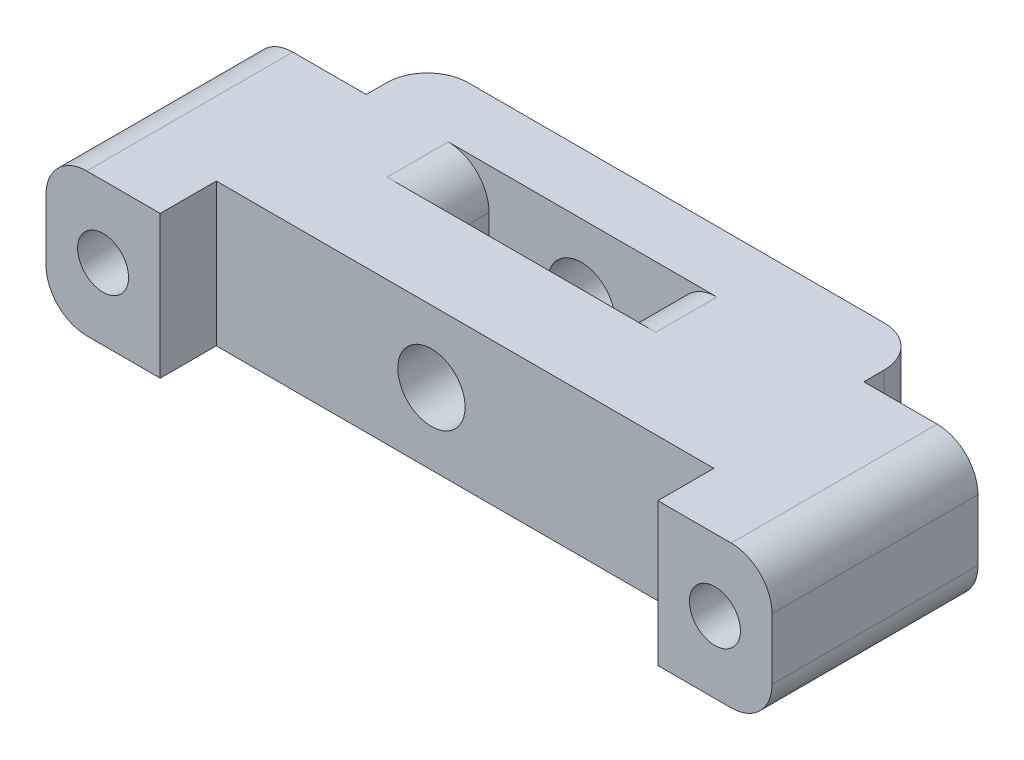
ISO-10303-21;
HEADER;
FILE_DESCRIPTION(('STEP AP214'),'2;1');
FILE_NAME('part.step','',(''),(''),'','','');
FILE_SCHEMA(('AUTOMOTIVE_DESIGN { 1 0 10303 214 1 1 1 1 }'));
ENDSEC;
DATA;
#1=APPLICATION_CONTEXT('core data for automotive mechanical design processes');
#2=APPLICATION_PROTOCOL_DEFINITION('international standard','automotive_design',2000,#1);
#3=PRODUCT_CONTEXT('',#1,'mechanical');
#4=PRODUCT('Part','Part','',(#3));
#5=PRODUCT_RELATED_PRODUCT_CATEGORY('part','',(#4));
#6=PRODUCT_DEFINITION_FORMATION('','',#4);
#7=PRODUCT_DEFINITION_CONTEXT('part definition',#1,'design');
#8=PRODUCT_DEFINITION('design','',#6,#7);
#9=PRODUCT_DEFINITION_SHAPE('','',#8);
#10=(LENGTH_UNIT() NAMED_UNIT(*) SI_UNIT(.MILLI.,.METRE.));
#11=(NAMED_UNIT(*) PLANE_ANGLE_UNIT() SI_UNIT($,.RADIAN.));
#12=(NAMED_UNIT(*) SI_UNIT($,.STERADIAN.) SOLID_ANGLE_UNIT());
#13=UNCERTAINTY_MEASURE_WITH_UNIT(LENGTH_MEASURE(1.E-05),#10,'distance_accuracy_value','');
#14=(GEOMETRIC_REPRESENTATION_CONTEXT(3) GLOBAL_UNCERTAINTY_ASSIGNED_CONTEXT((#13)) GLOBAL_UNIT_ASSIGNED_CONTEXT((#10,
#11,#12)) REPRESENTATION_CONTEXT('',''));
#15=CARTESIAN_POINT('',(0.,0.,0.));
#16=DIRECTION('',(0.,0.,1.));
#17=DIRECTION('',(1.,0.,0.));
#18=AXIS2_PLACEMENT_3D('',#15,#16,#17);
#19=CARTESIAN_POINT('',(17.8,3.5,-10.35));
#20=DIRECTION('',(-1.,0.,0.));
#21=DIRECTION('',(0.,0.,1.));
#22=AXIS2_PLACEMENT_3D('',#19,#20,#21);
#23=PLANE('',#22);
#24=DIRECTION('',(0.,-1.,0.));
#25=VECTOR('',#24,1.);
#26=CARTESIAN_POINT('',(17.8,-3.5,-7.35));
#27=LINE('',#26,#25);
#28=CARTESIAN_POINT('',(17.8,1.5,-7.35));
#29=VERTEX_POINT('',#28);
#30=CARTESIAN_POINT('',(17.8,-1.5,-7.35));
#31=VERTEX_POINT('',#30);
#32=EDGE_CURVE('E234',#29,#31,#27,.T.);
#33=ORIENTED_EDGE('',*,*,#32,.F.);
#34=DIRECTION('',(0.,0.,-1.));
#35=VECTOR('',#34,1.);
#36=CARTESIAN_POINT('',(17.8,1.5,-10.35));
#37=LINE('',#36,#35);
#38=CARTESIAN_POINT('',(17.8,1.5,2.75));
#39=VERTEX_POINT('',#38);
#40=EDGE_CURVE('E389',#29,#39,#37,.F.);
#41=ORIENTED_EDGE('',*,*,#40,.T.);
#42=DIRECTION('',(0.,-1.,0.));
#43=VECTOR('',#42,1.);
#44=CARTESIAN_POINT('',(17.8,3.5,2.75));
#45=LINE('',#44,#43);
#46=CARTESIAN_POINT('',(17.8,-1.5,2.75));
#47=VERTEX_POINT('',#46);
#48=EDGE_CURVE('E335',#39,#47,#45,.T.);
#49=ORIENTED_EDGE('',*,*,#48,.T.);
#50=DIRECTION('',(0.,0.,-1.));
#51=VECTOR('',#50,1.);
#52=CARTESIAN_POINT('',(17.8,-1.5,-7.35));
#53=LINE('',#52,#51);
#54=EDGE_CURVE('E386',#47,#31,#53,.T.);
#55=ORIENTED_EDGE('',*,*,#54,.T.);
#56=EDGE_LOOP('',(#33,#41,#49,#55));
#57=FACE_BOUND('',#56,.T.);
#58=ADVANCED_FACE('F32',(#57),#23,.F.);
#59=CARTESIAN_POINT('',(15.,0.,2.75));
#60=DIRECTION('',(0.,0.,-1.));
#61=DIRECTION('',(-1.,0.,0.));
#62=AXIS2_PLACEMENT_3D('',#59,#60,#61);
#63=CYLINDRICAL_SURFACE('',#62,1.25);
#64=CARTESIAN_POINT('',(15.,0.,2.75));
#65=DIRECTION('',(0.,0.,-1.));
#66=DIRECTION('',(1.,0.,0.));
#67=AXIS2_PLACEMENT_3D('',#64,#65,#66);
#68=CIRCLE('',#67,1.25);
#69=CARTESIAN_POINT('',(16.25,0.,2.75));
#70=VERTEX_POINT('',#69);
#71=EDGE_CURVE('E256',#70,#70,#68,.T.);
#72=ORIENTED_EDGE('',*,*,#71,.F.);
#73=EDGE_LOOP('',(#72));
#74=FACE_BOUND('',#73,.T.);
#75=CARTESIAN_POINT('',(15.,0.,-7.35));
#76=DIRECTION('',(0.,0.,-1.));
#77=DIRECTION('',(-1.,0.,0.));
#78=AXIS2_PLACEMENT_3D('',#75,#76,#77);
#79=CIRCLE('',#78,1.25);
#80=CARTESIAN_POINT('',(13.75,0.,-7.35));
#81=VERTEX_POINT('',#80);
#82=EDGE_CURVE('E236',#81,#81,#79,.F.);
#83=ORIENTED_EDGE('',*,*,#82,.F.);
#84=EDGE_LOOP('',(#83));
#85=FACE_BOUND('',#84,.T.);
#86=ADVANCED_FACE('F480',(#74,#85),#63,.F.);
#87=CARTESIAN_POINT('',(-17.8,3.5,-10.35));
#88=DIRECTION('',(1.,0.,0.));
#89=DIRECTION('',(0.,0.,-1.));
#90=AXIS2_PLACEMENT_3D('',#87,#88,#89);
#91=PLANE('',#90);
#92=DIRECTION('',(0.,-1.,0.));
#93=VECTOR('',#92,1.);
#94=CARTESIAN_POINT('',(-17.8,3.5,2.75));
#95=LINE('',#94,#93);
#96=CARTESIAN_POINT('',(-17.8,1.5,2.75));
#97=VERTEX_POINT('',#96);
#98=CARTESIAN_POINT('',(-17.8,-1.5,2.75));
#99=VERTEX_POINT('',#98);
#100=EDGE_CURVE('E332',#97,#99,#95,.T.);
#101=ORIENTED_EDGE('',*,*,#100,.F.);
#102=DIRECTION('',(0.,0.,1.));
#103=VECTOR('',#102,1.);
#104=CARTESIAN_POINT('',(-17.8,1.5,-10.35));
#105=LINE('',#104,#103);
#106=CARTESIAN_POINT('',(-17.8,1.5,-7.35));
#107=VERTEX_POINT('',#106);
#108=EDGE_CURVE('E47',#97,#107,#105,.F.);
#109=ORIENTED_EDGE('',*,*,#108,.T.);
#110=DIRECTION('',(0.,1.,0.));
#111=VECTOR('',#110,1.);
#112=CARTESIAN_POINT('',(-17.8,-3.5,-7.35));
#113=LINE('',#112,#111);
#114=CARTESIAN_POINT('',(-17.8,-1.5,-7.35));
#115=VERTEX_POINT('',#114);
#116=EDGE_CURVE('E240',#115,#107,#113,.T.);
#117=ORIENTED_EDGE('',*,*,#116,.F.);
#118=DIRECTION('',(0.,0.,1.));
#119=VECTOR('',#118,1.);
#120=CARTESIAN_POINT('',(-17.8,-1.5,2.75));
#121=LINE('',#120,#119);
#122=EDGE_CURVE('E399',#115,#99,#121,.T.);
#123=ORIENTED_EDGE('',*,*,#122,.T.);
#124=EDGE_LOOP('',(#101,#109,#117,#123));
#125=FACE_BOUND('',#124,.T.);
#126=ADVANCED_FACE('F486',(#125),#91,.F.);
#127=CARTESIAN_POINT('',(-15.,0.,2.75));
#128=DIRECTION('',(0.,0.,-1.));
#129=DIRECTION('',(-1.,0.,0.));
#130=AXIS2_PLACEMENT_3D('',#127,#128,#129);
#131=CYLINDRICAL_SURFACE('',#130,1.25);
#132=CARTESIAN_POINT('',(-15.,0.,2.75));
#133=DIRECTION('',(0.,0.,-1.));
#134=DIRECTION('',(-1.,0.,0.));
#135=AXIS2_PLACEMENT_3D('',#132,#133,#134);
#136=CIRCLE('',#135,1.25);
#137=CARTESIAN_POINT('',(-16.25,0.,2.75));
#138=VERTEX_POINT('',#137);
#139=EDGE_CURVE('E269',#138,#138,#136,.T.);
#140=ORIENTED_EDGE('',*,*,#139,.F.);
#141=EDGE_LOOP('',(#140));
#142=FACE_BOUND('',#141,.T.);
#143=CARTESIAN_POINT('',(-15.,0.,-7.35));
#144=DIRECTION('',(0.,0.,-1.));
#145=DIRECTION('',(-1.,0.,0.));
#146=AXIS2_PLACEMENT_3D('',#143,#144,#145);
#147=CIRCLE('',#146,1.25);
#148=CARTESIAN_POINT('',(-16.25,0.,-7.35));
#149=VERTEX_POINT('',#148);
#150=EDGE_CURVE('E253',#149,#149,#147,.F.);
#151=ORIENTED_EDGE('',*,*,#150,.F.);
#152=EDGE_LOOP('',(#151));
#153=FACE_BOUND('',#152,.T.);
#154=ADVANCED_FACE('F597',(#142,#153),#131,.F.);
#155=CARTESIAN_POINT('',(0.,3.5,0.));
#156=DIRECTION('',(0.,-1.,0.));
#157=DIRECTION('',(0.,0.,-1.));
#158=AXIS2_PLACEMENT_3D('',#155,#156,#157);
#159=PLANE('',#158);
#160=DIRECTION('',(1.,0.,0.));
#161=VECTOR('',#160,1.);
#162=CARTESIAN_POINT('',(17.8,3.5,2.75));
#163=LINE('',#162,#161);
#164=CARTESIAN_POINT('',(12.2,3.5,2.75));
#165=VERTEX_POINT('',#164);
#166=CARTESIAN_POINT('',(15.8,3.5,2.75));
#167=VERTEX_POINT('',#166);
#168=EDGE_CURVE('E293',#165,#167,#163,.T.);
#169=ORIENTED_EDGE('',*,*,#168,.T.);
#170=DIRECTION('',(0.,0.,-1.));
#171=VECTOR('',#170,1.);
#172=CARTESIAN_POINT('',(15.8,3.5,0.));
#173=LINE('',#172,#171);
#174=CARTESIAN_POINT('',(15.8,3.5,-7.35));
#175=VERTEX_POINT('',#174);
#176=EDGE_CURVE('E374',#167,#175,#173,.T.);
#177=ORIENTED_EDGE('',*,*,#176,.T.);
#178=DIRECTION('',(1.,0.,0.));
#179=VECTOR('',#178,1.);
#180=CARTESIAN_POINT('',(17.8,3.5,-7.35));
#181=LINE('',#180,#179);
#182=CARTESIAN_POINT('',(12.2,3.5,-7.35));
#183=VERTEX_POINT('',#182);
#184=EDGE_CURVE('E227',#183,#175,#181,.T.);
#185=ORIENTED_EDGE('',*,*,#184,.F.);
#186=DIRECTION('',(0.,0.,-1.));
#187=VECTOR('',#186,1.);
#188=CARTESIAN_POINT('',(12.2,3.5,-7.35));
#189=LINE('',#188,#187);
#190=CARTESIAN_POINT('',(12.2,3.5,-8.35));
#191=VERTEX_POINT('',#190);
#192=EDGE_CURVE('E226',#183,#191,#189,.T.);
#193=ORIENTED_EDGE('',*,*,#192,.T.);
#194=CARTESIAN_POINT('',(10.2,3.5,-8.35));
#195=DIRECTION('',(0.,-1.,0.));
#196=DIRECTION('',(0.,0.,-1.));
#197=AXIS2_PLACEMENT_3D('',#194,#195,#196);
#198=CIRCLE('',#197,2.);
#199=CARTESIAN_POINT('',(10.2,3.5,-10.35));
#200=VERTEX_POINT('',#199);
#201=EDGE_CURVE('E369',#191,#200,#198,.F.);
#202=ORIENTED_EDGE('',*,*,#201,.T.);
#203=DIRECTION('',(-1.,0.,0.));
#204=VECTOR('',#203,1.);
#205=CARTESIAN_POINT('',(-17.8,3.5,-10.35));
#206=LINE('',#205,#204);
#207=CARTESIAN_POINT('',(-10.2,3.5,-10.35));
#208=VERTEX_POINT('',#207);
#209=EDGE_CURVE('E296',#200,#208,#206,.T.);
#210=ORIENTED_EDGE('',*,*,#209,.T.);
#211=CARTESIAN_POINT('',(-10.2,3.5,-8.35));
#212=DIRECTION('',(0.,-1.,0.));
#213=DIRECTION('',(0.,0.,-1.));
#214=AXIS2_PLACEMENT_3D('',#211,#212,#213);
#215=CIRCLE('',#214,2.);
#216=CARTESIAN_POINT('',(-12.2,3.5,-8.35));
#217=VERTEX_POINT('',#216);
#218=EDGE_CURVE('E367',#208,#217,#215,.F.);
#219=ORIENTED_EDGE('',*,*,#218,.T.);
#220=DIRECTION('',(0.,0.,-1.));
#221=VECTOR('',#220,1.);
#222=CARTESIAN_POINT('',(-12.2,3.5,-7.35));
#223=LINE('',#222,#221);
#224=CARTESIAN_POINT('',(-12.2,3.5,-7.35));
#225=VERTEX_POINT('',#224);
#226=EDGE_CURVE('E249',#225,#217,#223,.T.);
#227=ORIENTED_EDGE('',*,*,#226,.F.);
#228=DIRECTION('',(1.,0.,0.));
#229=VECTOR('',#228,1.);
#230=CARTESIAN_POINT('',(-17.8,3.5,-7.35));
#231=LINE('',#230,#229);
#232=CARTESIAN_POINT('',(-15.8,3.5,-7.35));
#233=VERTEX_POINT('',#232);
#234=EDGE_CURVE('E242',#233,#225,#231,.T.);
#235=ORIENTED_EDGE('',*,*,#234,.F.);
#236=DIRECTION('',(0.,0.,1.));
#237=VECTOR('',#236,1.);
#238=CARTESIAN_POINT('',(-15.8,3.5,0.));
#239=LINE('',#238,#237);
#240=CARTESIAN_POINT('',(-15.8,3.5,2.75));
#241=VERTEX_POINT('',#240);
#242=EDGE_CURVE('E371',#233,#241,#239,.T.);
#243=ORIENTED_EDGE('',*,*,#242,.T.);
#244=DIRECTION('',(1.,0.,0.));
#245=VECTOR('',#244,1.);
#246=CARTESIAN_POINT('',(-17.8,3.5,2.75));
#247=LINE('',#246,#245);
#248=CARTESIAN_POINT('',(-12.2,3.5,2.75));
#249=VERTEX_POINT('',#248);
#250=EDGE_CURVE('E300',#241,#249,#247,.T.);
#251=ORIENTED_EDGE('',*,*,#250,.T.);
#252=DIRECTION('',(0.,0.,-1.));
#253=VECTOR('',#252,1.);
#254=CARTESIAN_POINT('',(-12.2,3.5,2.75));
#255=LINE('',#254,#253);
#256=CARTESIAN_POINT('',(-12.2,3.5,0.));
#257=VERTEX_POINT('',#256);
#258=EDGE_CURVE('E302',#249,#257,#255,.T.);
#259=ORIENTED_EDGE('',*,*,#258,.T.);
#260=DIRECTION('',(1.,0.,0.));
#261=VECTOR('',#260,1.);
#262=CARTESIAN_POINT('',(12.2,3.5,0.));
#263=LINE('',#262,#261);
#264=CARTESIAN_POINT('',(12.2,3.5,0.));
#265=VERTEX_POINT('',#264);
#266=EDGE_CURVE('E304',#257,#265,#263,.T.);
#267=ORIENTED_EDGE('',*,*,#266,.T.);
#268=DIRECTION('',(0.,0.,1.));
#269=VECTOR('',#268,1.);
#270=CARTESIAN_POINT('',(12.2,3.5,2.75));
#271=LINE('',#270,#269);
#272=EDGE_CURVE('E306',#265,#165,#271,.T.);
#273=ORIENTED_EDGE('',*,*,#272,.T.);
#274=EDGE_LOOP('',(#169,#177,#185,#193,#202,#210,#219,#227,#235,#243,#251,#259,#267,#273));
#275=FACE_BOUND('',#274,.T.);
#276=DIRECTION('',(-1.,0.,0.));
#277=VECTOR('',#276,1.);
#278=CARTESIAN_POINT('',(-6.175,3.5,-7.35));
#279=LINE('',#278,#277);
#280=CARTESIAN_POINT('',(5.,3.5,-7.35));
#281=VERTEX_POINT('',#280);
#282=CARTESIAN_POINT('',(-8.175,3.5,-7.35));
#283=VERTEX_POINT('',#282);
#284=EDGE_CURVE('E275',#281,#283,#279,.T.);
#285=ORIENTED_EDGE('',*,*,#284,.F.);
#286=DIRECTION('',(0.,0.,-1.));
#287=VECTOR('',#286,1.);
#288=CARTESIAN_POINT('',(5.,3.5,-4.35));
#289=LINE('',#288,#287);
#290=CARTESIAN_POINT('',(5.,3.5,-4.35));
#291=VERTEX_POINT('',#290);
#292=EDGE_CURVE('E380',#281,#291,#289,.F.);
#293=ORIENTED_EDGE('',*,*,#292,.T.);
#294=DIRECTION('',(1.,0.,0.));
#295=VECTOR('',#294,1.);
#296=CARTESIAN_POINT('',(-6.175,3.5,-4.35));
#297=LINE('',#296,#295);
#298=CARTESIAN_POINT('',(-8.175,3.5,-4.35));
#299=VERTEX_POINT('',#298);
#300=EDGE_CURVE('E273',#299,#291,#297,.T.);
#301=ORIENTED_EDGE('',*,*,#300,.F.);
#302=DIRECTION('',(0.,0.,1.));
#303=VECTOR('',#302,1.);
#304=CARTESIAN_POINT('',(-8.175,3.5,-7.35));
#305=LINE('',#304,#303);
#306=EDGE_CURVE('E377',#299,#283,#305,.F.);
#307=ORIENTED_EDGE('',*,*,#306,.T.);
#308=EDGE_LOOP('',(#285,#293,#301,#307));
#309=FACE_BOUND('',#308,.T.);
#310=ADVANCED_FACE('F439',(#275,#309),#159,.F.);
#311=CARTESIAN_POINT('',(0.,-3.5,0.));
#312=DIRECTION('',(0.,-1.,0.));
#313=DIRECTION('',(0.,0.,-1.));
#314=AXIS2_PLACEMENT_3D('',#311,#312,#313);
#315=PLANE('',#314);
#316=DIRECTION('',(-1.,0.,0.));
#317=VECTOR('',#316,1.);
#318=CARTESIAN_POINT('',(17.8,-3.5,-7.35));
#319=LINE('',#318,#317);
#320=CARTESIAN_POINT('',(15.8,-3.5,-7.35));
#321=VERTEX_POINT('',#320);
#322=CARTESIAN_POINT('',(12.2,-3.5,-7.35));
#323=VERTEX_POINT('',#322);
#324=EDGE_CURVE('E206',#321,#323,#319,.T.);
#325=ORIENTED_EDGE('',*,*,#324,.F.);
#326=DIRECTION('',(0.,0.,-1.));
#327=VECTOR('',#326,1.);
#328=CARTESIAN_POINT('',(15.8,-3.5,2.75));
#329=LINE('',#328,#327);
#330=CARTESIAN_POINT('',(15.8,-3.5,2.75));
#331=VERTEX_POINT('',#330);
#332=EDGE_CURVE('E349',#321,#331,#329,.F.);
#333=ORIENTED_EDGE('',*,*,#332,.T.);
#334=DIRECTION('',(1.,0.,0.));
#335=VECTOR('',#334,1.);
#336=CARTESIAN_POINT('',(17.8,-3.5,2.75));
#337=LINE('',#336,#335);
#338=CARTESIAN_POINT('',(12.2,-3.5,2.75));
#339=VERTEX_POINT('',#338);
#340=EDGE_CURVE('E292',#339,#331,#337,.T.);
#341=ORIENTED_EDGE('',*,*,#340,.F.);
#342=DIRECTION('',(0.,0.,1.));
#343=VECTOR('',#342,1.);
#344=CARTESIAN_POINT('',(12.2,-3.5,2.75));
#345=LINE('',#344,#343);
#346=CARTESIAN_POINT('',(12.2,-3.5,0.));
#347=VERTEX_POINT('',#346);
#348=EDGE_CURVE('E297',#347,#339,#345,.T.);
#349=ORIENTED_EDGE('',*,*,#348,.F.);
#350=DIRECTION('',(1.,0.,0.));
#351=VECTOR('',#350,1.);
#352=CARTESIAN_POINT('',(12.2,-3.5,0.));
#353=LINE('',#352,#351);
#354=CARTESIAN_POINT('',(-12.2,-3.5,0.));
#355=VERTEX_POINT('',#354);
#356=EDGE_CURVE('E318',#355,#347,#353,.T.);
#357=ORIENTED_EDGE('',*,*,#356,.F.);
#358=DIRECTION('',(0.,0.,-1.));
#359=VECTOR('',#358,1.);
#360=CARTESIAN_POINT('',(-12.2,-3.5,2.75));
#361=LINE('',#360,#359);
#362=CARTESIAN_POINT('',(-12.2,-3.5,2.75));
#363=VERTEX_POINT('',#362);
#364=EDGE_CURVE('E316',#363,#355,#361,.T.);
#365=ORIENTED_EDGE('',*,*,#364,.F.);
#366=DIRECTION('',(1.,0.,0.));
#367=VECTOR('',#366,1.);
#368=CARTESIAN_POINT('',(-17.8,-3.5,2.75));
#369=LINE('',#368,#367);
#370=CARTESIAN_POINT('',(-15.8,-3.5,2.75));
#371=VERTEX_POINT('',#370);
#372=EDGE_CURVE('E314',#371,#363,#369,.T.);
#373=ORIENTED_EDGE('',*,*,#372,.F.);
#374=DIRECTION('',(0.,0.,1.));
#375=VECTOR('',#374,1.);
#376=CARTESIAN_POINT('',(-15.8,-3.5,-7.35));
#377=LINE('',#376,#375);
#378=CARTESIAN_POINT('',(-15.8,-3.5,-7.35));
#379=VERTEX_POINT('',#378);
#380=EDGE_CURVE('E347',#371,#379,#377,.F.);
#381=ORIENTED_EDGE('',*,*,#380,.T.);
#382=DIRECTION('',(-1.,0.,0.));
#383=VECTOR('',#382,1.);
#384=CARTESIAN_POINT('',(-17.8,-3.5,-7.35));
#385=LINE('',#384,#383);
#386=CARTESIAN_POINT('',(-12.2,-3.5,-7.35));
#387=VERTEX_POINT('',#386);
#388=EDGE_CURVE('E247',#387,#379,#385,.T.);
#389=ORIENTED_EDGE('',*,*,#388,.F.);
#390=DIRECTION('',(0.,0.,-1.));
#391=VECTOR('',#390,1.);
#392=CARTESIAN_POINT('',(-12.2,-3.5,-7.35));
#393=LINE('',#392,#391);
#394=CARTESIAN_POINT('',(-12.2,-3.5,-8.35));
#395=VERTEX_POINT('',#394);
#396=EDGE_CURVE('E250',#387,#395,#393,.T.);
#397=ORIENTED_EDGE('',*,*,#396,.T.);
#398=CARTESIAN_POINT('',(-10.2,-3.5,-8.35));
#399=DIRECTION('',(0.,-1.,0.));
#400=DIRECTION('',(0.,0.,-1.));
#401=AXIS2_PLACEMENT_3D('',#398,#399,#400);
#402=CIRCLE('',#401,2.);
#403=CARTESIAN_POINT('',(-10.2,-3.5,-10.35));
#404=VERTEX_POINT('',#403);
#405=EDGE_CURVE('E338',#395,#404,#402,.T.);
#406=ORIENTED_EDGE('',*,*,#405,.T.);
#407=DIRECTION('',(-1.,0.,0.));
#408=VECTOR('',#407,1.);
#409=CARTESIAN_POINT('',(-17.8,-3.5,-10.35));
#410=LINE('',#409,#408);
#411=CARTESIAN_POINT('',(10.2,-3.5,-10.35));
#412=VERTEX_POINT('',#411);
#413=EDGE_CURVE('E311',#412,#404,#410,.T.);
#414=ORIENTED_EDGE('',*,*,#413,.F.);
#415=CARTESIAN_POINT('',(10.2,-3.5,-8.35));
#416=DIRECTION('',(0.,-1.,0.));
#417=DIRECTION('',(0.,0.,-1.));
#418=AXIS2_PLACEMENT_3D('',#415,#416,#417);
#419=CIRCLE('',#418,2.);
#420=CARTESIAN_POINT('',(12.2,-3.5,-8.35));
#421=VERTEX_POINT('',#420);
#422=EDGE_CURVE('E233',#412,#421,#419,.T.);
#423=ORIENTED_EDGE('',*,*,#422,.T.);
#424=DIRECTION('',(0.,0.,-1.));
#425=VECTOR('',#424,1.);
#426=CARTESIAN_POINT('',(12.2,-3.5,-7.35));
#427=LINE('',#426,#425);
#428=EDGE_CURVE('E223',#323,#421,#427,.T.);
#429=ORIENTED_EDGE('',*,*,#428,.F.);
#430=EDGE_LOOP('',(#325,#333,#341,#349,#357,#365,#373,#381,#389,#397,#406,#414,#423,#429));
#431=FACE_BOUND('',#430,.T.);
#432=DIRECTION('',(0.,0.,-1.));
#433=VECTOR('',#432,1.);
#434=CARTESIAN_POINT('',(5.,-3.5,0.));
#435=LINE('',#434,#433);
#436=CARTESIAN_POINT('',(5.,-3.5,-4.35));
#437=VERTEX_POINT('',#436);
#438=CARTESIAN_POINT('',(5.,-3.5,-7.35));
#439=VERTEX_POINT('',#438);
#440=EDGE_CURVE('E354',#437,#439,#435,.T.);
#441=ORIENTED_EDGE('',*,*,#440,.T.);
#442=DIRECTION('',(-1.,0.,0.));
#443=VECTOR('',#442,1.);
#444=CARTESIAN_POINT('',(-6.175,-3.5,-7.35));
#445=LINE('',#444,#443);
#446=CARTESIAN_POINT('',(-8.175,-3.5,-7.35));
#447=VERTEX_POINT('',#446);
#448=EDGE_CURVE('E276',#439,#447,#445,.T.);
#449=ORIENTED_EDGE('',*,*,#448,.T.);
#450=DIRECTION('',(0.,0.,1.));
#451=VECTOR('',#450,1.);
#452=CARTESIAN_POINT('',(-8.175,-3.5,0.));
#453=LINE('',#452,#451);
#454=CARTESIAN_POINT('',(-8.175,-3.5,-4.35));
#455=VERTEX_POINT('',#454);
#456=EDGE_CURVE('E351',#447,#455,#453,.T.);
#457=ORIENTED_EDGE('',*,*,#456,.T.);
#458=DIRECTION('',(1.,0.,0.));
#459=VECTOR('',#458,1.);
#460=CARTESIAN_POINT('',(-6.175,-3.5,-4.35));
#461=LINE('',#460,#459);
#462=EDGE_CURVE('E272',#455,#437,#461,.T.);
#463=ORIENTED_EDGE('',*,*,#462,.T.);
#464=EDGE_LOOP('',(#441,#449,#457,#463));
#465=FACE_BOUND('',#464,.T.);
#466=ADVANCED_FACE('F229',(#431,#465),#315,.T.);
#467=CARTESIAN_POINT('',(17.8,3.5,2.75));
#468=DIRECTION('',(0.,0.,-1.));
#469=DIRECTION('',(-1.,0.,0.));
#470=AXIS2_PLACEMENT_3D('',#467,#468,#469);
#471=PLANE('',#470);
#472=ORIENTED_EDGE('',*,*,#71,.T.);
#473=EDGE_LOOP('',(#472));
#474=FACE_BOUND('',#473,.T.);
#475=ORIENTED_EDGE('',*,*,#48,.F.);
#476=CARTESIAN_POINT('',(15.8,1.5,2.75));
#477=DIRECTION('',(0.,0.,-1.));
#478=DIRECTION('',(-1.,0.,0.));
#479=AXIS2_PLACEMENT_3D('',#476,#477,#478);
#480=CIRCLE('',#479,2.);
#481=EDGE_CURVE('E393',#39,#167,#480,.F.);
#482=ORIENTED_EDGE('',*,*,#481,.T.);
#483=ORIENTED_EDGE('',*,*,#168,.F.);
#484=DIRECTION('',(0.,-1.,0.));
#485=VECTOR('',#484,1.);
#486=CARTESIAN_POINT('',(12.2,3.5,2.75));
#487=LINE('',#486,#485);
#488=EDGE_CURVE('E308',#165,#339,#487,.T.);
#489=ORIENTED_EDGE('',*,*,#488,.T.);
#490=ORIENTED_EDGE('',*,*,#340,.T.);
#491=CARTESIAN_POINT('',(15.8,-1.5,2.75));
#492=DIRECTION('',(0.,0.,-1.));
#493=DIRECTION('',(-1.,0.,0.));
#494=AXIS2_PLACEMENT_3D('',#491,#492,#493);
#495=CIRCLE('',#494,2.);
#496=EDGE_CURVE('E391',#331,#47,#495,.F.);
#497=ORIENTED_EDGE('',*,*,#496,.T.);
#498=EDGE_LOOP('',(#475,#482,#483,#489,#490,#497));
#499=FACE_BOUND('',#498,.T.);
#500=ADVANCED_FACE('F494',(#474,#499),#471,.F.);
#501=CARTESIAN_POINT('',(-17.8,3.5,-10.35));
#502=DIRECTION('',(0.,0.,1.));
#503=DIRECTION('',(1.,0.,0.));
#504=AXIS2_PLACEMENT_3D('',#501,#502,#503);
#505=PLANE('',#504);
#506=CARTESIAN_POINT('',(-1.65,0.,-10.35));
#507=DIRECTION('',(0.,0.,-1.));
#508=DIRECTION('',(-1.,0.,0.));
#509=AXIS2_PLACEMENT_3D('',#506,#507,#508);
#510=CIRCLE('',#509,1.65);
#511=CARTESIAN_POINT('',(-3.3,0.,-10.35));
#512=VERTEX_POINT('',#511);
#513=EDGE_CURVE('E259',#512,#512,#510,.T.);
#514=ORIENTED_EDGE('',*,*,#513,.F.);
#515=EDGE_LOOP('',(#514));
#516=FACE_BOUND('',#515,.T.);
#517=ORIENTED_EDGE('',*,*,#209,.F.);
#518=DIRECTION('',(0.,1.,0.));
#519=VECTOR('',#518,1.);
#520=CARTESIAN_POINT('',(10.2,3.5,-10.35));
#521=LINE('',#520,#519);
#522=EDGE_CURVE('E410',#200,#412,#521,.F.);
#523=ORIENTED_EDGE('',*,*,#522,.T.);
#524=ORIENTED_EDGE('',*,*,#413,.T.);
#525=DIRECTION('',(0.,-1.,0.));
#526=VECTOR('',#525,1.);
#527=CARTESIAN_POINT('',(-10.2,3.5,-10.35));
#528=LINE('',#527,#526);
#529=EDGE_CURVE('E408',#404,#208,#528,.F.);
#530=ORIENTED_EDGE('',*,*,#529,.T.);
#531=EDGE_LOOP('',(#517,#523,#524,#530));
#532=FACE_BOUND('',#531,.T.);
#533=ADVANCED_FACE('F492',(#516,#532),#505,.F.);
#534=CARTESIAN_POINT('',(-17.8,3.5,2.75));
#535=DIRECTION('',(0.,0.,-1.));
#536=DIRECTION('',(-1.,0.,0.));
#537=AXIS2_PLACEMENT_3D('',#534,#535,#536);
#538=PLANE('',#537);
#539=ORIENTED_EDGE('',*,*,#139,.T.);
#540=EDGE_LOOP('',(#539));
#541=FACE_BOUND('',#540,.T.);
#542=ORIENTED_EDGE('',*,*,#250,.F.);
#543=CARTESIAN_POINT('',(-15.8,1.5,2.75));
#544=DIRECTION('',(0.,0.,-1.));
#545=DIRECTION('',(-1.,0.,0.));
#546=AXIS2_PLACEMENT_3D('',#543,#544,#545);
#547=CIRCLE('',#546,2.);
#548=EDGE_CURVE('E397',#241,#97,#547,.F.);
#549=ORIENTED_EDGE('',*,*,#548,.T.);
#550=ORIENTED_EDGE('',*,*,#100,.T.);
#551=CARTESIAN_POINT('',(-15.8,-1.5,2.75));
#552=DIRECTION('',(0.,0.,-1.));
#553=DIRECTION('',(-1.,0.,0.));
#554=AXIS2_PLACEMENT_3D('',#551,#552,#553);
#555=CIRCLE('',#554,2.);
#556=EDGE_CURVE('E395',#99,#371,#555,.F.);
#557=ORIENTED_EDGE('',*,*,#556,.T.);
#558=ORIENTED_EDGE('',*,*,#372,.T.);
#559=DIRECTION('',(0.,-1.,0.));
#560=VECTOR('',#559,1.);
#561=CARTESIAN_POINT('',(-12.2,3.5,2.75));
#562=LINE('',#561,#560);
#563=EDGE_CURVE('E329',#249,#363,#562,.T.);
#564=ORIENTED_EDGE('',*,*,#563,.F.);
#565=EDGE_LOOP('',(#542,#549,#550,#557,#558,#564));
#566=FACE_BOUND('',#565,.T.);
#567=ADVANCED_FACE('F557',(#541,#566),#538,.F.);
#568=CARTESIAN_POINT('',(-12.2,3.5,2.75));
#569=DIRECTION('',(-1.,0.,0.));
#570=DIRECTION('',(0.,0.,1.));
#571=AXIS2_PLACEMENT_3D('',#568,#569,#570);
#572=PLANE('',#571);
#573=ORIENTED_EDGE('',*,*,#364,.T.);
#574=DIRECTION('',(0.,-1.,0.));
#575=VECTOR('',#574,1.);
#576=CARTESIAN_POINT('',(-12.2,3.5,0.));
#577=LINE('',#576,#575);
#578=EDGE_CURVE('E326',#257,#355,#577,.T.);
#579=ORIENTED_EDGE('',*,*,#578,.F.);
#580=ORIENTED_EDGE('',*,*,#258,.F.);
#581=ORIENTED_EDGE('',*,*,#563,.T.);
#582=EDGE_LOOP('',(#573,#579,#580,#581));
#583=FACE_BOUND('',#582,.T.);
#584=ADVANCED_FACE('F553',(#583),#572,.F.);
#585=CARTESIAN_POINT('',(12.2,3.5,0.));
#586=DIRECTION('',(0.,0.,-1.));
#587=DIRECTION('',(-1.,0.,0.));
#588=AXIS2_PLACEMENT_3D('',#585,#586,#587);
#589=PLANE('',#588);
#590=CARTESIAN_POINT('',(-1.65,0.,0.));
#591=DIRECTION('',(0.,0.,-1.));
#592=DIRECTION('',(-1.,0.,0.));
#593=AXIS2_PLACEMENT_3D('',#590,#591,#592);
#594=CIRCLE('',#593,1.65);
#595=CARTESIAN_POINT('',(-3.3,0.,0.));
#596=VERTEX_POINT('',#595);
#597=EDGE_CURVE('E266',#596,#596,#594,.T.);
#598=ORIENTED_EDGE('',*,*,#597,.T.);
#599=EDGE_LOOP('',(#598));
#600=FACE_BOUND('',#599,.T.);
#601=ORIENTED_EDGE('',*,*,#356,.T.);
#602=DIRECTION('',(0.,-1.,0.));
#603=VECTOR('',#602,1.);
#604=CARTESIAN_POINT('',(12.2,3.5,0.));
#605=LINE('',#604,#603);
#606=EDGE_CURVE('E323',#265,#347,#605,.T.);
#607=ORIENTED_EDGE('',*,*,#606,.F.);
#608=ORIENTED_EDGE('',*,*,#266,.F.);
#609=ORIENTED_EDGE('',*,*,#578,.T.);
#610=EDGE_LOOP('',(#601,#607,#608,#609));
#611=FACE_BOUND('',#610,.T.);
#612=ADVANCED_FACE('F475',(#600,#611),#589,.F.);
#613=CARTESIAN_POINT('',(12.2,3.5,2.75));
#614=DIRECTION('',(1.,0.,0.));
#615=DIRECTION('',(0.,0.,-1.));
#616=AXIS2_PLACEMENT_3D('',#613,#614,#615);
#617=PLANE('',#616);
#618=ORIENTED_EDGE('',*,*,#348,.T.);
#619=ORIENTED_EDGE('',*,*,#488,.F.);
#620=ORIENTED_EDGE('',*,*,#272,.F.);
#621=ORIENTED_EDGE('',*,*,#606,.T.);
#622=EDGE_LOOP('',(#618,#619,#620,#621));
#623=FACE_BOUND('',#622,.T.);
#624=ADVANCED_FACE('F467',(#623),#617,.F.);
#625=CARTESIAN_POINT('',(-6.175,3.5,-7.35));
#626=DIRECTION('',(1.,0.,0.));
#627=DIRECTION('',(0.,0.,-1.));
#628=AXIS2_PLACEMENT_3D('',#625,#626,#627);
#629=PLANE('',#628);
#630=DIRECTION('',(0.,-1.,0.));
#631=VECTOR('',#630,1.);
#632=CARTESIAN_POINT('',(-6.175,3.5,-4.35));
#633=LINE('',#632,#631);
#634=CARTESIAN_POINT('',(-6.175,1.5,-4.35));
#635=VERTEX_POINT('',#634);
#636=CARTESIAN_POINT('',(-6.175,-1.5,-4.35));
#637=VERTEX_POINT('',#636);
#638=EDGE_CURVE('E289',#635,#637,#633,.T.);
#639=ORIENTED_EDGE('',*,*,#638,.T.);
#640=DIRECTION('',(0.,0.,1.));
#641=VECTOR('',#640,1.);
#642=CARTESIAN_POINT('',(-6.175,-1.5,-7.35));
#643=LINE('',#642,#641);
#644=CARTESIAN_POINT('',(-6.175,-1.5,-7.35));
#645=VERTEX_POINT('',#644);
#646=EDGE_CURVE('E365',#637,#645,#643,.F.);
#647=ORIENTED_EDGE('',*,*,#646,.T.);
#648=DIRECTION('',(0.,-1.,0.));
#649=VECTOR('',#648,1.);
#650=CARTESIAN_POINT('',(-6.175,3.5,-7.35));
#651=LINE('',#650,#649);
#652=CARTESIAN_POINT('',(-6.175,1.5,-7.35));
#653=VERTEX_POINT('',#652);
#654=EDGE_CURVE('E278',#653,#645,#651,.T.);
#655=ORIENTED_EDGE('',*,*,#654,.F.);
#656=DIRECTION('',(0.,0.,1.));
#657=VECTOR('',#656,1.);
#658=CARTESIAN_POINT('',(-6.175,1.5,-4.35));
#659=LINE('',#658,#657);
#660=EDGE_CURVE('E362',#653,#635,#659,.T.);
#661=ORIENTED_EDGE('',*,*,#660,.T.);
#662=EDGE_LOOP('',(#639,#647,#655,#661));
#663=FACE_BOUND('',#662,.T.);
#664=ADVANCED_FACE('F465',(#663),#629,.T.);
#665=CARTESIAN_POINT('',(-6.175,3.5,-4.35));
#666=DIRECTION('',(0.,0.,-1.));
#667=DIRECTION('',(-1.,0.,0.));
#668=AXIS2_PLACEMENT_3D('',#665,#666,#667);
#669=PLANE('',#668);
#670=CARTESIAN_POINT('',(-1.65,0.,-4.35));
#671=DIRECTION('',(0.,0.,-1.));
#672=DIRECTION('',(-1.,0.,0.));
#673=AXIS2_PLACEMENT_3D('',#670,#671,#672);
#674=CIRCLE('',#673,1.65);
#675=CARTESIAN_POINT('',(-3.3,0.,-4.35));
#676=VERTEX_POINT('',#675);
#677=EDGE_CURVE('E263',#676,#676,#674,.T.);
#678=ORIENTED_EDGE('',*,*,#677,.F.);
#679=EDGE_LOOP('',(#678));
#680=FACE_BOUND('',#679,.T.);
#681=ORIENTED_EDGE('',*,*,#462,.F.);
#682=CARTESIAN_POINT('',(-8.175,-1.5,-4.35));
#683=DIRECTION('',(0.,0.,-1.));
#684=DIRECTION('',(-1.,0.,0.));
#685=AXIS2_PLACEMENT_3D('',#682,#683,#684);
#686=CIRCLE('',#685,2.);
#687=EDGE_CURVE('E420',#455,#637,#686,.F.);
#688=ORIENTED_EDGE('',*,*,#687,.T.);
#689=ORIENTED_EDGE('',*,*,#638,.F.);
#690=CARTESIAN_POINT('',(-8.175,1.5,-4.35));
#691=DIRECTION('',(0.,0.,-1.));
#692=DIRECTION('',(-1.,0.,0.));
#693=AXIS2_PLACEMENT_3D('',#690,#691,#692);
#694=CIRCLE('',#693,2.);
#695=EDGE_CURVE('E40',#635,#299,#694,.F.);
#696=ORIENTED_EDGE('',*,*,#695,.T.);
#697=ORIENTED_EDGE('',*,*,#300,.T.);
#698=CARTESIAN_POINT('',(5.,1.5,-4.35));
#699=DIRECTION('',(0.,0.,-1.));
#700=DIRECTION('',(-1.,0.,0.));
#701=AXIS2_PLACEMENT_3D('',#698,#699,#700);
#702=CIRCLE('',#701,2.);
#703=CARTESIAN_POINT('',(3.,1.5,-4.35));
#704=VERTEX_POINT('',#703);
#705=EDGE_CURVE('E428',#291,#704,#702,.F.);
#706=ORIENTED_EDGE('',*,*,#705,.T.);
#707=DIRECTION('',(0.,-1.,0.));
#708=VECTOR('',#707,1.);
#709=CARTESIAN_POINT('',(3.,3.5,-4.35));
#710=LINE('',#709,#708);
#711=CARTESIAN_POINT('',(3.,-1.5,-4.35));
#712=VERTEX_POINT('',#711);
#713=EDGE_CURVE('E286',#704,#712,#710,.T.);
#714=ORIENTED_EDGE('',*,*,#713,.T.);
#715=CARTESIAN_POINT('',(5.,-1.5,-4.35));
#716=DIRECTION('',(0.,0.,-1.));
#717=DIRECTION('',(-1.,0.,0.));
#718=AXIS2_PLACEMENT_3D('',#715,#716,#717);
#719=CIRCLE('',#718,2.);
#720=EDGE_CURVE('E417',#712,#437,#719,.F.);
#721=ORIENTED_EDGE('',*,*,#720,.T.);
#722=EDGE_LOOP('',(#681,#688,#689,#696,#697,#706,#714,#721));
#723=FACE_BOUND('',#722,.T.);
#724=ADVANCED_FACE('F433',(#680,#723),#669,.T.);
#725=CARTESIAN_POINT('',(3.,3.5,-7.35));
#726=DIRECTION('',(-1.,0.,0.));
#727=DIRECTION('',(0.,0.,1.));
#728=AXIS2_PLACEMENT_3D('',#725,#726,#727);
#729=PLANE('',#728);
#730=DIRECTION('',(0.,-1.,0.));
#731=VECTOR('',#730,1.);
#732=CARTESIAN_POINT('',(3.,3.5,-7.35));
#733=LINE('',#732,#731);
#734=CARTESIAN_POINT('',(3.,1.5,-7.35));
#735=VERTEX_POINT('',#734);
#736=CARTESIAN_POINT('',(3.,-1.5,-7.35));
#737=VERTEX_POINT('',#736);
#738=EDGE_CURVE('E283',#735,#737,#733,.T.);
#739=ORIENTED_EDGE('',*,*,#738,.T.);
#740=DIRECTION('',(0.,0.,-1.));
#741=VECTOR('',#740,1.);
#742=CARTESIAN_POINT('',(3.,-1.5,-7.35));
#743=LINE('',#742,#741);
#744=EDGE_CURVE('E360',#737,#712,#743,.F.);
#745=ORIENTED_EDGE('',*,*,#744,.T.);
#746=ORIENTED_EDGE('',*,*,#713,.F.);
#747=DIRECTION('',(0.,0.,-1.));
#748=VECTOR('',#747,1.);
#749=CARTESIAN_POINT('',(3.,1.5,-7.35));
#750=LINE('',#749,#748);
#751=EDGE_CURVE('E357',#704,#735,#750,.T.);
#752=ORIENTED_EDGE('',*,*,#751,.T.);
#753=EDGE_LOOP('',(#739,#745,#746,#752));
#754=FACE_BOUND('',#753,.T.);
#755=ADVANCED_FACE('F448',(#754),#729,.T.);
#756=CARTESIAN_POINT('',(-6.175,3.5,-7.35));
#757=DIRECTION('',(0.,0.,1.));
#758=DIRECTION('',(1.,0.,0.));
#759=AXIS2_PLACEMENT_3D('',#756,#757,#758);
#760=PLANE('',#759);
#761=CARTESIAN_POINT('',(-1.65,0.,-7.35));
#762=DIRECTION('',(0.,0.,1.));
#763=DIRECTION('',(1.,0.,0.));
#764=AXIS2_PLACEMENT_3D('',#761,#762,#763);
#765=CIRCLE('',#764,1.65);
#766=CARTESIAN_POINT('',(0.,0.,-7.35));
#767=VERTEX_POINT('',#766);
#768=EDGE_CURVE('E262',#767,#767,#765,.T.);
#769=ORIENTED_EDGE('',*,*,#768,.F.);
#770=EDGE_LOOP('',(#769));
#771=FACE_BOUND('',#770,.T.);
#772=ORIENTED_EDGE('',*,*,#448,.F.);
#773=CARTESIAN_POINT('',(5.,-1.5,-7.35));
#774=DIRECTION('',(0.,0.,1.));
#775=DIRECTION('',(1.,0.,0.));
#776=AXIS2_PLACEMENT_3D('',#773,#774,#775);
#777=CIRCLE('',#776,2.);
#778=EDGE_CURVE('E415',#439,#737,#777,.F.);
#779=ORIENTED_EDGE('',*,*,#778,.T.);
#780=ORIENTED_EDGE('',*,*,#738,.F.);
#781=CARTESIAN_POINT('',(5.,1.5,-7.35));
#782=DIRECTION('',(0.,0.,1.));
#783=DIRECTION('',(1.,0.,0.));
#784=AXIS2_PLACEMENT_3D('',#781,#782,#783);
#785=CIRCLE('',#784,2.);
#786=EDGE_CURVE('E425',#735,#281,#785,.F.);
#787=ORIENTED_EDGE('',*,*,#786,.T.);
#788=ORIENTED_EDGE('',*,*,#284,.T.);
#789=CARTESIAN_POINT('',(-8.175,1.5,-7.35));
#790=DIRECTION('',(0.,0.,1.));
#791=DIRECTION('',(1.,0.,0.));
#792=AXIS2_PLACEMENT_3D('',#789,#790,#791);
#793=CIRCLE('',#792,2.);
#794=EDGE_CURVE('E11',#283,#653,#793,.F.);
#795=ORIENTED_EDGE('',*,*,#794,.T.);
#796=ORIENTED_EDGE('',*,*,#654,.T.);
#797=CARTESIAN_POINT('',(-8.175,-1.5,-7.35));
#798=DIRECTION('',(0.,0.,1.));
#799=DIRECTION('',(1.,0.,0.));
#800=AXIS2_PLACEMENT_3D('',#797,#798,#799);
#801=CIRCLE('',#800,2.);
#802=EDGE_CURVE('E422',#645,#447,#801,.F.);
#803=ORIENTED_EDGE('',*,*,#802,.T.);
#804=EDGE_LOOP('',(#772,#779,#780,#787,#788,#795,#796,#803));
#805=FACE_BOUND('',#804,.T.);
#806=ADVANCED_FACE('F462',(#771,#805),#760,.T.);
#807=CARTESIAN_POINT('',(-1.65,0.,2.75));
#808=DIRECTION('',(0.,0.,-1.));
#809=DIRECTION('',(-1.,0.,0.));
#810=AXIS2_PLACEMENT_3D('',#807,#808,#809);
#811=CYLINDRICAL_SURFACE('',#810,1.65);
#812=ORIENTED_EDGE('',*,*,#768,.T.);
#813=EDGE_LOOP('',(#812));
#814=FACE_BOUND('',#813,.T.);
#815=ORIENTED_EDGE('',*,*,#513,.T.);
#816=EDGE_LOOP('',(#815));
#817=FACE_BOUND('',#816,.T.);
#818=ADVANCED_FACE('F583',(#814,#817),#811,.F.);
#819=ORIENTED_EDGE('',*,*,#677,.T.);
#820=EDGE_LOOP('',(#819));
#821=FACE_BOUND('',#820,.T.);
#822=ORIENTED_EDGE('',*,*,#597,.F.);
#823=EDGE_LOOP('',(#822));
#824=FACE_BOUND('',#823,.T.);
#825=ADVANCED_FACE('F585',(#821,#824),#811,.F.);
#826=CARTESIAN_POINT('',(0.,0.,-7.35));
#827=DIRECTION('',(0.,0.,-1.));
#828=DIRECTION('',(-1.,0.,0.));
#829=AXIS2_PLACEMENT_3D('',#826,#827,#828);
#830=PLANE('',#829);
#831=ORIENTED_EDGE('',*,*,#116,.T.);
#832=CARTESIAN_POINT('',(-15.8,1.5,-7.35));
#833=DIRECTION('',(0.,0.,-1.));
#834=DIRECTION('',(-1.,0.,0.));
#835=AXIS2_PLACEMENT_3D('',#832,#833,#834);
#836=CIRCLE('',#835,2.);
#837=EDGE_CURVE('E404',#107,#233,#836,.T.);
#838=ORIENTED_EDGE('',*,*,#837,.T.);
#839=ORIENTED_EDGE('',*,*,#234,.T.);
#840=DIRECTION('',(0.,-1.,0.));
#841=VECTOR('',#840,1.);
#842=CARTESIAN_POINT('',(-12.2,-3.5,-7.35));
#843=LINE('',#842,#841);
#844=EDGE_CURVE('E244',#225,#387,#843,.T.);
#845=ORIENTED_EDGE('',*,*,#844,.T.);
#846=ORIENTED_EDGE('',*,*,#388,.T.);
#847=CARTESIAN_POINT('',(-15.8,-1.5,-7.35));
#848=DIRECTION('',(0.,0.,-1.));
#849=DIRECTION('',(-1.,0.,0.));
#850=AXIS2_PLACEMENT_3D('',#847,#848,#849);
#851=CIRCLE('',#850,2.);
#852=EDGE_CURVE('E54',#379,#115,#851,.T.);
#853=ORIENTED_EDGE('',*,*,#852,.T.);
#854=EDGE_LOOP('',(#831,#838,#839,#845,#846,#853));
#855=FACE_BOUND('',#854,.T.);
#856=ORIENTED_EDGE('',*,*,#150,.T.);
#857=EDGE_LOOP('',(#856));
#858=FACE_BOUND('',#857,.T.);
#859=ADVANCED_FACE('F566',(#855,#858),#830,.T.);
#860=CARTESIAN_POINT('',(-12.2,-3.5,-7.35));
#861=DIRECTION('',(1.,0.,0.));
#862=DIRECTION('',(0.,0.,-1.));
#863=AXIS2_PLACEMENT_3D('',#860,#861,#862);
#864=PLANE('',#863);
#865=ORIENTED_EDGE('',*,*,#226,.T.);
#866=DIRECTION('',(0.,-1.,0.));
#867=VECTOR('',#866,1.);
#868=CARTESIAN_POINT('',(-12.2,-3.5,-8.35));
#869=LINE('',#868,#867);
#870=EDGE_CURVE('E412',#217,#395,#869,.T.);
#871=ORIENTED_EDGE('',*,*,#870,.T.);
#872=ORIENTED_EDGE('',*,*,#396,.F.);
#873=ORIENTED_EDGE('',*,*,#844,.F.);
#874=EDGE_LOOP('',(#865,#871,#872,#873));
#875=FACE_BOUND('',#874,.T.);
#876=ADVANCED_FACE('F569',(#875),#864,.F.);
#877=CARTESIAN_POINT('',(0.,0.,-7.35));
#878=DIRECTION('',(0.,0.,-1.));
#879=DIRECTION('',(-1.,0.,0.));
#880=AXIS2_PLACEMENT_3D('',#877,#878,#879);
#881=PLANE('',#880);
#882=ORIENTED_EDGE('',*,*,#184,.T.);
#883=CARTESIAN_POINT('',(15.8,1.5,-7.35));
#884=DIRECTION('',(0.,0.,-1.));
#885=DIRECTION('',(-1.,0.,0.));
#886=AXIS2_PLACEMENT_3D('',#883,#884,#885);
#887=CIRCLE('',#886,2.);
#888=EDGE_CURVE('E384',#175,#29,#887,.T.);
#889=ORIENTED_EDGE('',*,*,#888,.T.);
#890=ORIENTED_EDGE('',*,*,#32,.T.);
#891=CARTESIAN_POINT('',(15.8,-1.5,-7.35));
#892=DIRECTION('',(0.,0.,-1.));
#893=DIRECTION('',(-1.,0.,0.));
#894=AXIS2_PLACEMENT_3D('',#891,#892,#893);
#895=CIRCLE('',#894,2.);
#896=EDGE_CURVE('E214',#31,#321,#895,.T.);
#897=ORIENTED_EDGE('',*,*,#896,.T.);
#898=ORIENTED_EDGE('',*,*,#324,.T.);
#899=DIRECTION('',(0.,1.,0.));
#900=VECTOR('',#899,1.);
#901=CARTESIAN_POINT('',(12.2,-3.5,-7.35));
#902=LINE('',#901,#900);
#903=EDGE_CURVE('E211',#323,#183,#902,.T.);
#904=ORIENTED_EDGE('',*,*,#903,.T.);
#905=EDGE_LOOP('',(#882,#889,#890,#897,#898,#904));
#906=FACE_BOUND('',#905,.T.);
#907=ORIENTED_EDGE('',*,*,#82,.T.);
#908=EDGE_LOOP('',(#907));
#909=FACE_BOUND('',#908,.T.);
#910=ADVANCED_FACE('F209',(#906,#909),#881,.T.);
#911=CARTESIAN_POINT('',(12.2,-3.5,-7.35));
#912=DIRECTION('',(-1.,0.,0.));
#913=DIRECTION('',(0.,0.,1.));
#914=AXIS2_PLACEMENT_3D('',#911,#912,#913);
#915=PLANE('',#914);
#916=ORIENTED_EDGE('',*,*,#428,.T.);
#917=DIRECTION('',(0.,1.,0.));
#918=VECTOR('',#917,1.);
#919=CARTESIAN_POINT('',(12.2,-3.5,-8.35));
#920=LINE('',#919,#918);
#921=EDGE_CURVE('E406',#421,#191,#920,.T.);
#922=ORIENTED_EDGE('',*,*,#921,.T.);
#923=ORIENTED_EDGE('',*,*,#192,.F.);
#924=ORIENTED_EDGE('',*,*,#903,.F.);
#925=EDGE_LOOP('',(#916,#922,#923,#924));
#926=FACE_BOUND('',#925,.T.);
#927=ADVANCED_FACE('F221',(#926),#915,.F.);
#928=CARTESIAN_POINT('',(5.,-1.5,0.));
#929=DIRECTION('',(0.,0.,-1.));
#930=DIRECTION('',(-1.,0.,0.));
#931=AXIS2_PLACEMENT_3D('',#928,#929,#930);
#932=CYLINDRICAL_SURFACE('',#931,2.);
#933=ORIENTED_EDGE('',*,*,#720,.F.);
#934=ORIENTED_EDGE('',*,*,#744,.F.);
#935=ORIENTED_EDGE('',*,*,#778,.F.);
#936=ORIENTED_EDGE('',*,*,#440,.F.);
#937=EDGE_LOOP('',(#933,#934,#935,#936));
#938=FACE_BOUND('',#937,.T.);
#939=ADVANCED_FACE('F453',(#938),#932,.T.);
#940=CARTESIAN_POINT('',(-8.175,-1.5,0.));
#941=DIRECTION('',(0.,0.,1.));
#942=DIRECTION('',(1.,0.,0.));
#943=AXIS2_PLACEMENT_3D('',#940,#941,#942);
#944=CYLINDRICAL_SURFACE('',#943,2.);
#945=ORIENTED_EDGE('',*,*,#802,.F.);
#946=ORIENTED_EDGE('',*,*,#646,.F.);
#947=ORIENTED_EDGE('',*,*,#687,.F.);
#948=ORIENTED_EDGE('',*,*,#456,.F.);
#949=EDGE_LOOP('',(#945,#946,#947,#948));
#950=FACE_BOUND('',#949,.T.);
#951=ADVANCED_FACE('F460',(#950),#944,.T.);
#952=CARTESIAN_POINT('',(5.,1.5,-7.35));
#953=DIRECTION('',(0.,0.,1.));
#954=DIRECTION('',(1.,0.,0.));
#955=AXIS2_PLACEMENT_3D('',#952,#953,#954);
#956=CYLINDRICAL_SURFACE('',#955,2.);
#957=ORIENTED_EDGE('',*,*,#705,.F.);
#958=ORIENTED_EDGE('',*,*,#292,.F.);
#959=ORIENTED_EDGE('',*,*,#786,.F.);
#960=ORIENTED_EDGE('',*,*,#751,.F.);
#961=EDGE_LOOP('',(#957,#958,#959,#960));
#962=FACE_BOUND('',#961,.T.);
#963=ADVANCED_FACE('F444',(#962),#956,.T.);
#964=CARTESIAN_POINT('',(-8.175,1.5,-7.35));
#965=DIRECTION('',(0.,0.,-1.));
#966=DIRECTION('',(-1.,0.,0.));
#967=AXIS2_PLACEMENT_3D('',#964,#965,#966);
#968=CYLINDRICAL_SURFACE('',#967,2.);
#969=ORIENTED_EDGE('',*,*,#794,.F.);
#970=ORIENTED_EDGE('',*,*,#306,.F.);
#971=ORIENTED_EDGE('',*,*,#695,.F.);
#972=ORIENTED_EDGE('',*,*,#660,.F.);
#973=EDGE_LOOP('',(#969,#970,#971,#972));
#974=FACE_BOUND('',#973,.T.);
#975=ADVANCED_FACE('F437',(#974),#968,.T.);
#976=CARTESIAN_POINT('',(15.8,1.5,0.));
#977=DIRECTION('',(0.,0.,-1.));
#978=DIRECTION('',(-1.,0.,0.));
#979=AXIS2_PLACEMENT_3D('',#976,#977,#978);
#980=CYLINDRICAL_SURFACE('',#979,2.);
#981=ORIENTED_EDGE('',*,*,#481,.F.);
#982=ORIENTED_EDGE('',*,*,#40,.F.);
#983=ORIENTED_EDGE('',*,*,#888,.F.);
#984=ORIENTED_EDGE('',*,*,#176,.F.);
#985=EDGE_LOOP('',(#981,#982,#983,#984));
#986=FACE_BOUND('',#985,.T.);
#987=ADVANCED_FACE('F506',(#986),#980,.T.);
#988=CARTESIAN_POINT('',(15.8,-1.5,-10.35));
#989=DIRECTION('',(0.,0.,1.));
#990=DIRECTION('',(1.,0.,0.));
#991=AXIS2_PLACEMENT_3D('',#988,#989,#990);
#992=CYLINDRICAL_SURFACE('',#991,2.);
#993=ORIENTED_EDGE('',*,*,#496,.F.);
#994=ORIENTED_EDGE('',*,*,#332,.F.);
#995=ORIENTED_EDGE('',*,*,#896,.F.);
#996=ORIENTED_EDGE('',*,*,#54,.F.);
#997=EDGE_LOOP('',(#993,#994,#995,#996));
#998=FACE_BOUND('',#997,.T.);
#999=ADVANCED_FACE('F509',(#998),#992,.T.);
#1000=CARTESIAN_POINT('',(-15.8,1.5,0.));
#1001=DIRECTION('',(0.,0.,1.));
#1002=DIRECTION('',(1.,0.,0.));
#1003=AXIS2_PLACEMENT_3D('',#1000,#1001,#1002);
#1004=CYLINDRICAL_SURFACE('',#1003,2.);
#1005=ORIENTED_EDGE('',*,*,#837,.F.);
#1006=ORIENTED_EDGE('',*,*,#108,.F.);
#1007=ORIENTED_EDGE('',*,*,#548,.F.);
#1008=ORIENTED_EDGE('',*,*,#242,.F.);
#1009=EDGE_LOOP('',(#1005,#1006,#1007,#1008));
#1010=FACE_BOUND('',#1009,.T.);
#1011=ADVANCED_FACE('F513',(#1010),#1004,.T.);
#1012=CARTESIAN_POINT('',(-15.8,-1.5,-10.35));
#1013=DIRECTION('',(0.,0.,-1.));
#1014=DIRECTION('',(-1.,0.,0.));
#1015=AXIS2_PLACEMENT_3D('',#1012,#1013,#1014);
#1016=CYLINDRICAL_SURFACE('',#1015,2.);
#1017=ORIENTED_EDGE('',*,*,#852,.F.);
#1018=ORIENTED_EDGE('',*,*,#380,.F.);
#1019=ORIENTED_EDGE('',*,*,#556,.F.);
#1020=ORIENTED_EDGE('',*,*,#122,.F.);
#1021=EDGE_LOOP('',(#1017,#1018,#1019,#1020));
#1022=FACE_BOUND('',#1021,.T.);
#1023=ADVANCED_FACE('F517',(#1022),#1016,.T.);
#1024=CARTESIAN_POINT('',(10.2,-3.5,-8.35));
#1025=DIRECTION('',(0.,1.,0.));
#1026=DIRECTION('',(0.,0.,1.));
#1027=AXIS2_PLACEMENT_3D('',#1024,#1025,#1026);
#1028=CYLINDRICAL_SURFACE('',#1027,2.);
#1029=ORIENTED_EDGE('',*,*,#422,.F.);
#1030=ORIENTED_EDGE('',*,*,#522,.F.);
#1031=ORIENTED_EDGE('',*,*,#201,.F.);
#1032=ORIENTED_EDGE('',*,*,#921,.F.);
#1033=EDGE_LOOP('',(#1029,#1030,#1031,#1032));
#1034=FACE_BOUND('',#1033,.T.);
#1035=ADVANCED_FACE('F520',(#1034),#1028,.T.);
#1036=CARTESIAN_POINT('',(-10.2,-3.5,-8.35));
#1037=DIRECTION('',(0.,-1.,0.));
#1038=DIRECTION('',(0.,0.,-1.));
#1039=AXIS2_PLACEMENT_3D('',#1036,#1037,#1038);
#1040=CYLINDRICAL_SURFACE('',#1039,2.);
#1041=ORIENTED_EDGE('',*,*,#218,.F.);
#1042=ORIENTED_EDGE('',*,*,#529,.F.);
#1043=ORIENTED_EDGE('',*,*,#405,.F.);
#1044=ORIENTED_EDGE('',*,*,#870,.F.);
#1045=EDGE_LOOP('',(#1041,#1042,#1043,#1044));
#1046=FACE_BOUND('',#1045,.T.);
#1047=ADVANCED_FACE('F34',(#1046),#1040,.T.);
#1048=CLOSED_SHELL('',(#58,#86,#126,#154,#310,#466,#500,#533,#567,#584,#612,#624,#664,#724,#755,
#806,#818,#825,#859,#876,#910,#927,#939,#951,#963,#975,#987,#999,#1011,#1023,#1035,#1047));
#1049=MANIFOLD_SOLID_BREP('B2',#1048);
#1050=ADVANCED_BREP_SHAPE_REPRESENTATION('',(#18,#1049),#14);
#1051=SHAPE_DEFINITION_REPRESENTATION(#9,#1050);
ENDSEC;
END-ISO-10303-21;
